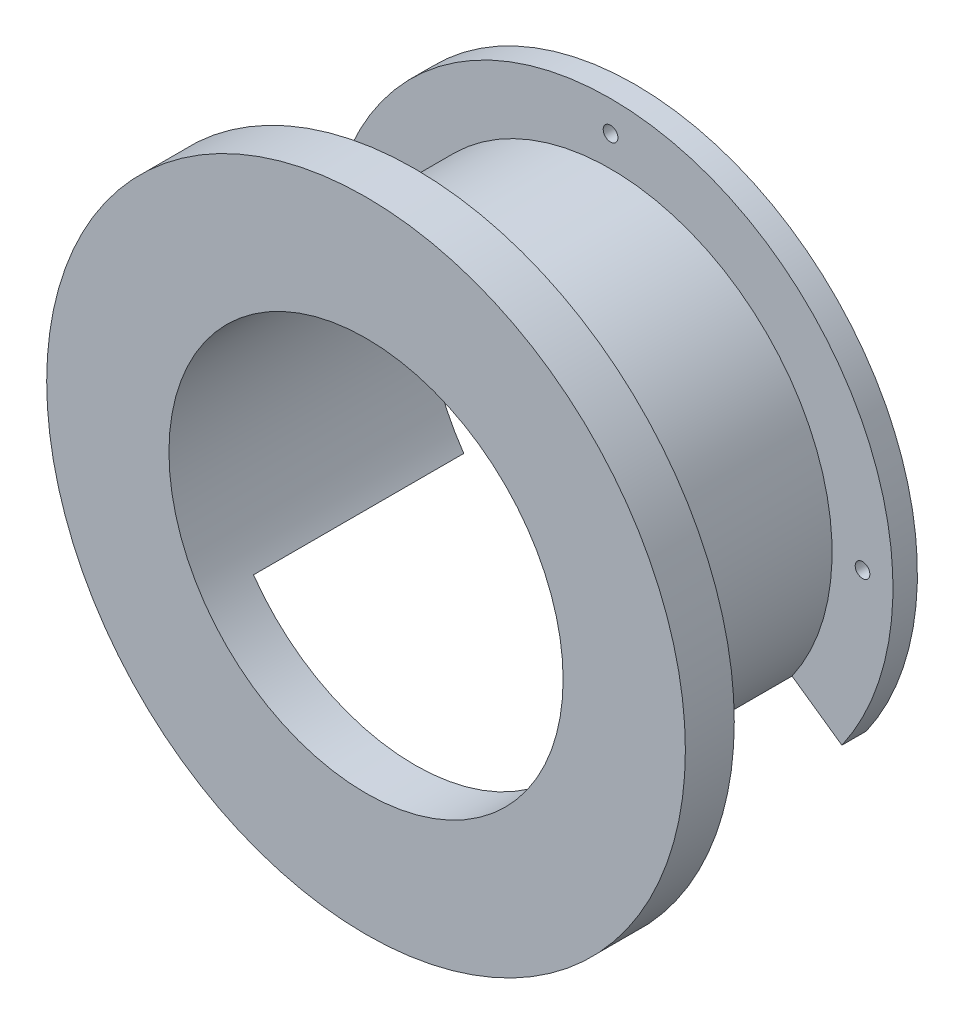
ISO-10303-21;
HEADER;
FILE_DESCRIPTION(('STEP AP214'),'2;1');
FILE_NAME('part.step','',(''),(''),'','','');
FILE_SCHEMA(('AUTOMOTIVE_DESIGN { 1 0 10303 214 1 1 1 1 }'));
ENDSEC;
DATA;
#1=APPLICATION_CONTEXT('core data for automotive mechanical design processes');
#2=APPLICATION_PROTOCOL_DEFINITION('international standard','automotive_design',2000,#1);
#3=PRODUCT_CONTEXT('',#1,'mechanical');
#4=PRODUCT('Part','Part','',(#3));
#5=PRODUCT_RELATED_PRODUCT_CATEGORY('part','',(#4));
#6=PRODUCT_DEFINITION_FORMATION('','',#4);
#7=PRODUCT_DEFINITION_CONTEXT('part definition',#1,'design');
#8=PRODUCT_DEFINITION('design','',#6,#7);
#9=PRODUCT_DEFINITION_SHAPE('','',#8);
#10=(LENGTH_UNIT() NAMED_UNIT(*) SI_UNIT(.MILLI.,.METRE.));
#11=(NAMED_UNIT(*) PLANE_ANGLE_UNIT() SI_UNIT($,.RADIAN.));
#12=(NAMED_UNIT(*) SI_UNIT($,.STERADIAN.) SOLID_ANGLE_UNIT());
#13=UNCERTAINTY_MEASURE_WITH_UNIT(LENGTH_MEASURE(1.E-05),#10,'distance_accuracy_value','');
#14=(GEOMETRIC_REPRESENTATION_CONTEXT(3) GLOBAL_UNCERTAINTY_ASSIGNED_CONTEXT((#13)) GLOBAL_UNIT_ASSIGNED_CONTEXT((#10,
#11,#12)) REPRESENTATION_CONTEXT('',''));
#15=CARTESIAN_POINT('',(0.,0.,0.));
#16=DIRECTION('',(0.,0.,1.));
#17=DIRECTION('',(1.,0.,0.));
#18=AXIS2_PLACEMENT_3D('',#15,#16,#17);
#19=CARTESIAN_POINT('',(-94.6120611153787,-66.2480783985456,10.));
#20=DIRECTION('',(-0.573576436351044,0.819152044288993,0.));
#21=DIRECTION('',(-0.819152044288993,-0.573576436351044,0.));
#22=AXIS2_PLACEMENT_3D('',#19,#20,#21);
#23=PLANE('',#22);
#24=DIRECTION('',(0.819152044288992,0.573576436351046,0.));
#25=VECTOR('',#24,1.);
#26=CARTESIAN_POINT('',(-74.2151752125827,-51.9660251334046,90.));
#27=LINE('',#26,#25);
#28=CARTESIAN_POINT('',(-74.2151752125827,-51.9660251334046,90.));
#29=VERTEX_POINT('',#28);
#30=CARTESIAN_POINT('',(-66.0236547696928,-46.2302607698941,90.));
#31=VERTEX_POINT('',#30);
#32=EDGE_CURVE('E118',#29,#31,#27,.T.);
#33=ORIENTED_EDGE('',*,*,#32,.F.);
#34=DIRECTION('',(0.,0.,1.));
#35=VECTOR('',#34,1.);
#36=CARTESIAN_POINT('',(-74.2151752125827,-51.9660251334046,-230.561296670405));
#37=LINE('',#36,#35);
#38=CARTESIAN_POINT('',(-74.2151752125827,-51.9660251334046,10.));
#39=VERTEX_POINT('',#38);
#40=EDGE_CURVE('E127',#39,#29,#37,.T.);
#41=ORIENTED_EDGE('',*,*,#40,.F.);
#42=DIRECTION('',(0.819152044288993,0.573576436351044,0.));
#43=VECTOR('',#42,1.);
#44=CARTESIAN_POINT('',(-94.6120611153787,-66.2480783985456,10.));
#45=LINE('',#44,#43);
#46=CARTESIAN_POINT('',(-94.6120611153787,-66.2480783985456,10.));
#47=VERTEX_POINT('',#46);
#48=EDGE_CURVE('E84',#47,#39,#45,.T.);
#49=ORIENTED_EDGE('',*,*,#48,.F.);
#50=DIRECTION('',(0.,0.,-1.));
#51=VECTOR('',#50,1.);
#52=CARTESIAN_POINT('',(-94.6120611153787,-66.2480783985456,10.));
#53=LINE('',#52,#51);
#54=CARTESIAN_POINT('',(-94.6120611153787,-66.2480783985456,0.));
#55=VERTEX_POINT('',#54);
#56=EDGE_CURVE('E12',#47,#55,#53,.T.);
#57=ORIENTED_EDGE('',*,*,#56,.T.);
#58=DIRECTION('',(0.819152044288993,0.573576436351044,0.));
#59=VECTOR('',#58,1.);
#60=CARTESIAN_POINT('',(-94.6120611153787,-66.2480783985456,0.));
#61=LINE('',#60,#59);
#62=CARTESIAN_POINT('',(-74.2151752125827,-51.9660251334046,0.));
#63=VERTEX_POINT('',#62);
#64=EDGE_CURVE('E156',#55,#63,#61,.T.);
#65=ORIENTED_EDGE('',*,*,#64,.T.);
#66=DIRECTION('',(0.,0.,-1.));
#67=VECTOR('',#66,1.);
#68=CARTESIAN_POINT('',(-74.2151752125827,-51.9660251334046,10.));
#69=LINE('',#68,#67);
#70=CARTESIAN_POINT('',(-74.2151752125827,-51.9660251334046,4.));
#71=VERTEX_POINT('',#70);
#72=EDGE_CURVE('E48',#71,#63,#69,.T.);
#73=ORIENTED_EDGE('',*,*,#72,.F.);
#74=DIRECTION('',(-0.81915204428899,-0.573576436351048,0.));
#75=VECTOR('',#74,1.);
#76=CARTESIAN_POINT('',(-66.0236547696928,-46.2302607698941,4.));
#77=LINE('',#76,#75);
#78=CARTESIAN_POINT('',(-66.0236547696928,-46.2302607698941,4.));
#79=VERTEX_POINT('',#78);
#80=EDGE_CURVE('E144',#79,#71,#77,.T.);
#81=ORIENTED_EDGE('',*,*,#80,.F.);
#82=DIRECTION('',(0.,0.,1.));
#83=VECTOR('',#82,1.);
#84=CARTESIAN_POINT('',(-66.0236547696928,-46.2302607698941,-230.561296670405));
#85=LINE('',#84,#83);
#86=EDGE_CURVE('E130',#79,#31,#85,.T.);
#87=ORIENTED_EDGE('',*,*,#86,.T.);
#88=EDGE_LOOP('',(#33,#41,#49,#57,#65,#73,#81,#87));
#89=FACE_BOUND('',#88,.T.);
#90=ADVANCED_FACE('F39',(#89),#23,.F.);
#91=CARTESIAN_POINT('',(94.6120611153787,-66.2480783985456,10.));
#92=DIRECTION('',(0.573576436351044,0.819152044288993,0.));
#93=DIRECTION('',(-0.819152044288993,0.573576436351044,0.));
#94=AXIS2_PLACEMENT_3D('',#91,#92,#93);
#95=PLANE('',#94);
#96=DIRECTION('',(0.819152044288993,-0.573576436351044,0.));
#97=VECTOR('',#96,1.);
#98=CARTESIAN_POINT('',(66.0236547696928,-46.2302607698941,90.));
#99=LINE('',#98,#97);
#100=CARTESIAN_POINT('',(66.0236547696928,-46.2302607698941,90.));
#101=VERTEX_POINT('',#100);
#102=CARTESIAN_POINT('',(74.2151752125827,-51.9660251334046,90.));
#103=VERTEX_POINT('',#102);
#104=EDGE_CURVE('E121',#101,#103,#99,.T.);
#105=ORIENTED_EDGE('',*,*,#104,.F.);
#106=DIRECTION('',(0.,0.,1.));
#107=VECTOR('',#106,1.);
#108=CARTESIAN_POINT('',(66.0236547696928,-46.2302607698941,-230.561296670405));
#109=LINE('',#108,#107);
#110=CARTESIAN_POINT('',(66.0236547696928,-46.2302607698941,4.));
#111=VERTEX_POINT('',#110);
#112=EDGE_CURVE('E137',#111,#101,#109,.T.);
#113=ORIENTED_EDGE('',*,*,#112,.F.);
#114=DIRECTION('',(-0.819152044288993,0.573576436351044,0.));
#115=VECTOR('',#114,1.);
#116=CARTESIAN_POINT('',(66.0236547696928,-46.2302607698941,4.));
#117=LINE('',#116,#115);
#118=CARTESIAN_POINT('',(74.2151752125827,-51.9660251334046,4.));
#119=VERTEX_POINT('',#118);
#120=EDGE_CURVE('E180',#119,#111,#117,.T.);
#121=ORIENTED_EDGE('',*,*,#120,.F.);
#122=DIRECTION('',(0.,0.,-1.));
#123=VECTOR('',#122,1.);
#124=CARTESIAN_POINT('',(74.2151752125827,-51.9660251334046,10.));
#125=LINE('',#124,#123);
#126=CARTESIAN_POINT('',(74.2151752125827,-51.9660251334046,0.));
#127=VERTEX_POINT('',#126);
#128=EDGE_CURVE('E75',#119,#127,#125,.T.);
#129=ORIENTED_EDGE('',*,*,#128,.T.);
#130=DIRECTION('',(0.819152044288993,-0.573576436351044,0.));
#131=VECTOR('',#130,1.);
#132=CARTESIAN_POINT('',(94.6120611153787,-66.2480783985456,0.));
#133=LINE('',#132,#131);
#134=CARTESIAN_POINT('',(94.6120611153787,-66.2480783985456,0.));
#135=VERTEX_POINT('',#134);
#136=EDGE_CURVE('E78',#127,#135,#133,.T.);
#137=ORIENTED_EDGE('',*,*,#136,.T.);
#138=DIRECTION('',(0.,0.,-1.));
#139=VECTOR('',#138,1.);
#140=CARTESIAN_POINT('',(94.6120611153787,-66.2480783985456,10.));
#141=LINE('',#140,#139);
#142=CARTESIAN_POINT('',(94.6120611153787,-66.2480783985456,10.));
#143=VERTEX_POINT('',#142);
#144=EDGE_CURVE('E153',#143,#135,#141,.T.);
#145=ORIENTED_EDGE('',*,*,#144,.F.);
#146=DIRECTION('',(0.819152044288993,-0.573576436351044,0.));
#147=VECTOR('',#146,1.);
#148=CARTESIAN_POINT('',(94.6120611153787,-66.2480783985456,10.));
#149=LINE('',#148,#147);
#150=CARTESIAN_POINT('',(74.2151752125827,-51.9660251334046,10.));
#151=VERTEX_POINT('',#150);
#152=EDGE_CURVE('E56',#151,#143,#149,.T.);
#153=ORIENTED_EDGE('',*,*,#152,.F.);
#154=DIRECTION('',(0.,0.,1.));
#155=VECTOR('',#154,1.);
#156=CARTESIAN_POINT('',(74.2151752125827,-51.9660251334046,-230.561296670405));
#157=LINE('',#156,#155);
#158=EDGE_CURVE('E175',#151,#103,#157,.T.);
#159=ORIENTED_EDGE('',*,*,#158,.T.);
#160=EDGE_LOOP('',(#105,#113,#121,#129,#137,#145,#153,#159));
#161=FACE_BOUND('',#160,.T.);
#162=ADVANCED_FACE('F174',(#161),#95,.F.);
#163=CARTESIAN_POINT('',(0.,0.,-230.561296670405));
#164=DIRECTION('',(0.,0.,1.));
#165=DIRECTION('',(1.,0.,0.));
#166=AXIS2_PLACEMENT_3D('',#163,#164,#165);
#167=CYLINDRICAL_SURFACE('',#166,90.5999999999999);
#168=ORIENTED_EDGE('',*,*,#40,.T.);
#169=CARTESIAN_POINT('',(0.,0.,90.));
#170=DIRECTION('',(0.,0.,1.));
#171=DIRECTION('',(1.,0.,0.));
#172=AXIS2_PLACEMENT_3D('',#169,#170,#171);
#173=CIRCLE('',#172,90.5999999999999);
#174=EDGE_CURVE('E114',#103,#29,#173,.T.);
#175=ORIENTED_EDGE('',*,*,#174,.F.);
#176=ORIENTED_EDGE('',*,*,#158,.F.);
#177=CARTESIAN_POINT('',(0.,0.,10.));
#178=DIRECTION('',(0.,0.,-1.));
#179=DIRECTION('',(1.,0.,0.));
#180=AXIS2_PLACEMENT_3D('',#177,#178,#179);
#181=CIRCLE('',#180,90.5999999999999);
#182=EDGE_CURVE('E134',#39,#151,#181,.T.);
#183=ORIENTED_EDGE('',*,*,#182,.F.);
#184=EDGE_LOOP('',(#168,#175,#176,#183));
#185=FACE_BOUND('',#184,.T.);
#186=ADVANCED_FACE('F133',(#185),#167,.T.);
#187=CARTESIAN_POINT('',(0.,0.,10.));
#188=DIRECTION('',(0.,0.,-1.));
#189=DIRECTION('',(-1.,0.,0.));
#190=AXIS2_PLACEMENT_3D('',#187,#188,#189);
#191=CYLINDRICAL_SURFACE('',#190,90.5999999999999);
#192=CARTESIAN_POINT('',(0.,0.,4.));
#193=DIRECTION('',(0.,0.,1.));
#194=DIRECTION('',(1.,0.,0.));
#195=AXIS2_PLACEMENT_3D('',#192,#193,#194);
#196=CIRCLE('',#195,90.5999999999999);
#197=EDGE_CURVE('E147',#71,#119,#196,.F.);
#198=ORIENTED_EDGE('',*,*,#197,.F.);
#199=ORIENTED_EDGE('',*,*,#72,.T.);
#200=CARTESIAN_POINT('',(0.,0.,0.));
#201=DIRECTION('',(0.,0.,-1.));
#202=DIRECTION('',(1.,0.,0.));
#203=AXIS2_PLACEMENT_3D('',#200,#201,#202);
#204=CIRCLE('',#203,90.5999999999999);
#205=EDGE_CURVE('E159',#63,#127,#204,.T.);
#206=ORIENTED_EDGE('',*,*,#205,.T.);
#207=ORIENTED_EDGE('',*,*,#128,.F.);
#208=EDGE_LOOP('',(#198,#199,#206,#207));
#209=FACE_BOUND('',#208,.T.);
#210=ADVANCED_FACE('F166',(#209),#191,.F.);
#211=CARTESIAN_POINT('',(0.,0.,10.));
#212=DIRECTION('',(0.,0.,-1.));
#213=DIRECTION('',(-1.,0.,0.));
#214=AXIS2_PLACEMENT_3D('',#211,#212,#213);
#215=CYLINDRICAL_SURFACE('',#214,115.5);
#216=CARTESIAN_POINT('',(0.,0.,0.));
#217=DIRECTION('',(0.,0.,1.));
#218=DIRECTION('',(1.,0.,0.));
#219=AXIS2_PLACEMENT_3D('',#216,#217,#218);
#220=CIRCLE('',#219,115.5);
#221=EDGE_CURVE('E146',#135,#55,#220,.T.);
#222=ORIENTED_EDGE('',*,*,#221,.T.);
#223=ORIENTED_EDGE('',*,*,#56,.F.);
#224=CARTESIAN_POINT('',(0.,0.,10.));
#225=DIRECTION('',(0.,0.,1.));
#226=DIRECTION('',(1.,0.,0.));
#227=AXIS2_PLACEMENT_3D('',#224,#225,#226);
#228=CIRCLE('',#227,115.5);
#229=EDGE_CURVE('E148',#143,#47,#228,.T.);
#230=ORIENTED_EDGE('',*,*,#229,.F.);
#231=ORIENTED_EDGE('',*,*,#144,.T.);
#232=EDGE_LOOP('',(#222,#223,#230,#231));
#233=FACE_BOUND('',#232,.T.);
#234=ADVANCED_FACE('F41',(#233),#215,.T.);
#235=CARTESIAN_POINT('',(0.,0.,10.));
#236=DIRECTION('',(0.,0.,1.));
#237=DIRECTION('',(1.,0.,0.));
#238=AXIS2_PLACEMENT_3D('',#235,#236,#237);
#239=PLANE('',#238);
#240=CARTESIAN_POINT('',(-103.05,0.,10.));
#241=DIRECTION('',(0.,0.,1.));
#242=DIRECTION('',(1.,0.,0.));
#243=AXIS2_PLACEMENT_3D('',#240,#241,#242);
#244=CIRCLE('',#243,3.);
#245=CARTESIAN_POINT('',(-100.05,0.,10.));
#246=VERTEX_POINT('',#245);
#247=EDGE_CURVE('E206',#246,#246,#244,.T.);
#248=ORIENTED_EDGE('',*,*,#247,.F.);
#249=EDGE_LOOP('',(#248));
#250=FACE_BOUND('',#249,.T.);
#251=CARTESIAN_POINT('',(103.05,0.,10.));
#252=DIRECTION('',(0.,0.,1.));
#253=DIRECTION('',(1.,0.,0.));
#254=AXIS2_PLACEMENT_3D('',#251,#252,#253);
#255=CIRCLE('',#254,3.);
#256=CARTESIAN_POINT('',(106.05,0.,10.));
#257=VERTEX_POINT('',#256);
#258=EDGE_CURVE('E200',#257,#257,#255,.T.);
#259=ORIENTED_EDGE('',*,*,#258,.F.);
#260=EDGE_LOOP('',(#259));
#261=FACE_BOUND('',#260,.T.);
#262=CARTESIAN_POINT('',(0.,103.05,10.));
#263=DIRECTION('',(0.,0.,1.));
#264=DIRECTION('',(1.,0.,0.));
#265=AXIS2_PLACEMENT_3D('',#262,#263,#264);
#266=CIRCLE('',#265,3.);
#267=CARTESIAN_POINT('',(3.,103.05,10.));
#268=VERTEX_POINT('',#267);
#269=EDGE_CURVE('E194',#268,#268,#266,.T.);
#270=ORIENTED_EDGE('',*,*,#269,.F.);
#271=EDGE_LOOP('',(#270));
#272=FACE_BOUND('',#271,.T.);
#273=ORIENTED_EDGE('',*,*,#229,.T.);
#274=ORIENTED_EDGE('',*,*,#48,.T.);
#275=ORIENTED_EDGE('',*,*,#182,.T.);
#276=ORIENTED_EDGE('',*,*,#152,.T.);
#277=EDGE_LOOP('',(#273,#274,#275,#276));
#278=FACE_BOUND('',#277,.T.);
#279=ADVANCED_FACE('F212',(#250,#261,#272,#278),#239,.T.);
#280=CARTESIAN_POINT('',(0.,0.,0.));
#281=DIRECTION('',(0.,0.,1.));
#282=DIRECTION('',(1.,0.,0.));
#283=AXIS2_PLACEMENT_3D('',#280,#281,#282);
#284=PLANE('',#283);
#285=CARTESIAN_POINT('',(-103.05,0.,0.));
#286=DIRECTION('',(0.,0.,1.));
#287=DIRECTION('',(1.,0.,0.));
#288=AXIS2_PLACEMENT_3D('',#285,#286,#287);
#289=CIRCLE('',#288,2.99999999999999);
#290=CARTESIAN_POINT('',(-100.05,0.,0.));
#291=VERTEX_POINT('',#290);
#292=EDGE_CURVE('E203',#291,#291,#289,.T.);
#293=ORIENTED_EDGE('',*,*,#292,.T.);
#294=EDGE_LOOP('',(#293));
#295=FACE_BOUND('',#294,.T.);
#296=CARTESIAN_POINT('',(103.05,0.,0.));
#297=DIRECTION('',(0.,0.,1.));
#298=DIRECTION('',(1.,0.,0.));
#299=AXIS2_PLACEMENT_3D('',#296,#297,#298);
#300=CIRCLE('',#299,2.99999999999999);
#301=CARTESIAN_POINT('',(106.05,0.,0.));
#302=VERTEX_POINT('',#301);
#303=EDGE_CURVE('E197',#302,#302,#300,.T.);
#304=ORIENTED_EDGE('',*,*,#303,.T.);
#305=EDGE_LOOP('',(#304));
#306=FACE_BOUND('',#305,.T.);
#307=CARTESIAN_POINT('',(0.,103.05,0.));
#308=DIRECTION('',(0.,0.,1.));
#309=DIRECTION('',(1.,0.,0.));
#310=AXIS2_PLACEMENT_3D('',#307,#308,#309);
#311=CIRCLE('',#310,3.);
#312=CARTESIAN_POINT('',(3.,103.05,0.));
#313=VERTEX_POINT('',#312);
#314=EDGE_CURVE('E125',#313,#313,#311,.T.);
#315=ORIENTED_EDGE('',*,*,#314,.T.);
#316=EDGE_LOOP('',(#315));
#317=FACE_BOUND('',#316,.T.);
#318=ORIENTED_EDGE('',*,*,#221,.F.);
#319=ORIENTED_EDGE('',*,*,#136,.F.);
#320=ORIENTED_EDGE('',*,*,#205,.F.);
#321=ORIENTED_EDGE('',*,*,#64,.F.);
#322=EDGE_LOOP('',(#318,#319,#320,#321));
#323=FACE_BOUND('',#322,.T.);
#324=ADVANCED_FACE('F171',(#295,#306,#317,#323),#284,.F.);
#325=CARTESIAN_POINT('',(0.,0.,-230.561296670405));
#326=DIRECTION('',(0.,0.,1.));
#327=DIRECTION('',(1.,0.,0.));
#328=AXIS2_PLACEMENT_3D('',#325,#326,#327);
#329=CYLINDRICAL_SURFACE('',#328,80.6);
#330=CARTESIAN_POINT('',(0.,0.,110.));
#331=DIRECTION('',(0.,0.,-1.));
#332=DIRECTION('',(1.,0.,0.));
#333=AXIS2_PLACEMENT_3D('',#330,#331,#332);
#334=CIRCLE('',#333,80.6);
#335=CARTESIAN_POINT('',(80.6,0.,110.));
#336=VERTEX_POINT('',#335);
#337=EDGE_CURVE('E135',#336,#336,#334,.T.);
#338=ORIENTED_EDGE('',*,*,#337,.F.);
#339=EDGE_LOOP('',(#338));
#340=FACE_BOUND('',#339,.T.);
#341=CARTESIAN_POINT('',(0.,0.,4.));
#342=DIRECTION('',(0.,0.,1.));
#343=DIRECTION('',(1.,0.,0.));
#344=AXIS2_PLACEMENT_3D('',#341,#342,#343);
#345=CIRCLE('',#344,80.6);
#346=EDGE_CURVE('E178',#111,#79,#345,.T.);
#347=ORIENTED_EDGE('',*,*,#346,.F.);
#348=ORIENTED_EDGE('',*,*,#112,.T.);
#349=CARTESIAN_POINT('',(0.,2.35922392732846E-13,90.));
#350=DIRECTION('',(0.,0.,1.));
#351=DIRECTION('',(1.,0.,0.));
#352=AXIS2_PLACEMENT_3D('',#349,#350,#351);
#353=CIRCLE('',#352,80.6000000000001);
#354=EDGE_CURVE('E131',#31,#101,#353,.T.);
#355=ORIENTED_EDGE('',*,*,#354,.F.);
#356=ORIENTED_EDGE('',*,*,#86,.F.);
#357=EDGE_LOOP('',(#347,#348,#355,#356));
#358=FACE_BOUND('',#357,.T.);
#359=ADVANCED_FACE('F243',(#340,#358),#329,.F.);
#360=CARTESIAN_POINT('',(0.,0.,4.));
#361=DIRECTION('',(0.,0.,1.));
#362=DIRECTION('',(1.,0.,0.));
#363=AXIS2_PLACEMENT_3D('',#360,#361,#362);
#364=PLANE('',#363);
#365=ORIENTED_EDGE('',*,*,#197,.T.);
#366=ORIENTED_EDGE('',*,*,#120,.T.);
#367=ORIENTED_EDGE('',*,*,#346,.T.);
#368=ORIENTED_EDGE('',*,*,#80,.T.);
#369=EDGE_LOOP('',(#365,#366,#367,#368));
#370=FACE_BOUND('',#369,.T.);
#371=ADVANCED_FACE('F250',(#370),#364,.F.);
#372=CARTESIAN_POINT('',(0.,0.,110.));
#373=DIRECTION('',(0.,0.,1.));
#374=DIRECTION('',(1.,0.,0.));
#375=AXIS2_PLACEMENT_3D('',#372,#373,#374);
#376=PLANE('',#375);
#377=ORIENTED_EDGE('',*,*,#337,.T.);
#378=EDGE_LOOP('',(#377));
#379=FACE_BOUND('',#378,.T.);
#380=CARTESIAN_POINT('',(0.,0.,110.));
#381=DIRECTION('',(0.,0.,1.));
#382=DIRECTION('',(1.,0.,0.));
#383=AXIS2_PLACEMENT_3D('',#380,#381,#382);
#384=CIRCLE('',#383,130.6);
#385=CARTESIAN_POINT('',(130.6,0.,110.));
#386=VERTEX_POINT('',#385);
#387=EDGE_CURVE('E185',#386,#386,#384,.T.);
#388=ORIENTED_EDGE('',*,*,#387,.T.);
#389=EDGE_LOOP('',(#388));
#390=FACE_BOUND('',#389,.T.);
#391=ADVANCED_FACE('F254',(#379,#390),#376,.T.);
#392=CARTESIAN_POINT('',(0.,0.,90.));
#393=DIRECTION('',(0.,0.,1.));
#394=DIRECTION('',(1.,0.,0.));
#395=AXIS2_PLACEMENT_3D('',#392,#393,#394);
#396=CYLINDRICAL_SURFACE('',#395,130.6);
#397=ORIENTED_EDGE('',*,*,#387,.F.);
#398=EDGE_LOOP('',(#397));
#399=FACE_BOUND('',#398,.T.);
#400=CARTESIAN_POINT('',(0.,0.,90.));
#401=DIRECTION('',(0.,0.,1.));
#402=DIRECTION('',(1.,0.,0.));
#403=AXIS2_PLACEMENT_3D('',#400,#401,#402);
#404=CIRCLE('',#403,130.6);
#405=CARTESIAN_POINT('',(130.6,0.,90.));
#406=VERTEX_POINT('',#405);
#407=EDGE_CURVE('E140',#406,#406,#404,.T.);
#408=ORIENTED_EDGE('',*,*,#407,.T.);
#409=EDGE_LOOP('',(#408));
#410=FACE_BOUND('',#409,.T.);
#411=ADVANCED_FACE('F231',(#399,#410),#396,.T.);
#412=CARTESIAN_POINT('',(0.,0.,90.));
#413=DIRECTION('',(0.,0.,1.));
#414=DIRECTION('',(1.,0.,0.));
#415=AXIS2_PLACEMENT_3D('',#412,#413,#414);
#416=PLANE('',#415);
#417=ORIENTED_EDGE('',*,*,#104,.T.);
#418=ORIENTED_EDGE('',*,*,#174,.T.);
#419=ORIENTED_EDGE('',*,*,#32,.T.);
#420=ORIENTED_EDGE('',*,*,#354,.T.);
#421=EDGE_LOOP('',(#417,#418,#419,#420));
#422=FACE_BOUND('',#421,.T.);
#423=ORIENTED_EDGE('',*,*,#407,.F.);
#424=EDGE_LOOP('',(#423));
#425=FACE_BOUND('',#424,.T.);
#426=ADVANCED_FACE('F116',(#422,#425),#416,.F.);
#427=CARTESIAN_POINT('',(0.,103.05,10.));
#428=DIRECTION('',(0.,0.,1.));
#429=DIRECTION('',(1.,0.,0.));
#430=AXIS2_PLACEMENT_3D('',#427,#428,#429);
#431=CYLINDRICAL_SURFACE('',#430,3.);
#432=ORIENTED_EDGE('',*,*,#314,.F.);
#433=EDGE_LOOP('',(#432));
#434=FACE_BOUND('',#433,.T.);
#435=ORIENTED_EDGE('',*,*,#269,.T.);
#436=EDGE_LOOP('',(#435));
#437=FACE_BOUND('',#436,.T.);
#438=ADVANCED_FACE('F220',(#434,#437),#431,.F.);
#439=CARTESIAN_POINT('',(103.05,0.,10.));
#440=DIRECTION('',(0.,0.,1.));
#441=DIRECTION('',(1.,0.,0.));
#442=AXIS2_PLACEMENT_3D('',#439,#440,#441);
#443=CYLINDRICAL_SURFACE('',#442,3.);
#444=ORIENTED_EDGE('',*,*,#303,.F.);
#445=EDGE_LOOP('',(#444));
#446=FACE_BOUND('',#445,.T.);
#447=ORIENTED_EDGE('',*,*,#258,.T.);
#448=EDGE_LOOP('',(#447));
#449=FACE_BOUND('',#448,.T.);
#450=ADVANCED_FACE('F222',(#446,#449),#443,.F.);
#451=CARTESIAN_POINT('',(-103.05,0.,10.));
#452=DIRECTION('',(0.,0.,1.));
#453=DIRECTION('',(1.,0.,0.));
#454=AXIS2_PLACEMENT_3D('',#451,#452,#453);
#455=CYLINDRICAL_SURFACE('',#454,3.);
#456=ORIENTED_EDGE('',*,*,#292,.F.);
#457=EDGE_LOOP('',(#456));
#458=FACE_BOUND('',#457,.T.);
#459=ORIENTED_EDGE('',*,*,#247,.T.);
#460=EDGE_LOOP('',(#459));
#461=FACE_BOUND('',#460,.T.);
#462=ADVANCED_FACE('F210',(#458,#461),#455,.F.);
#463=CLOSED_SHELL('',(#90,#162,#186,#210,#234,#279,#324,#359,#371,#391,#411,#426,#438,#450,#462));
#464=MANIFOLD_SOLID_BREP('B2',#463);
#465=ADVANCED_BREP_SHAPE_REPRESENTATION('',(#18,#464),#14);
#466=SHAPE_DEFINITION_REPRESENTATION(#9,#465);
ENDSEC;
END-ISO-10303-21;
